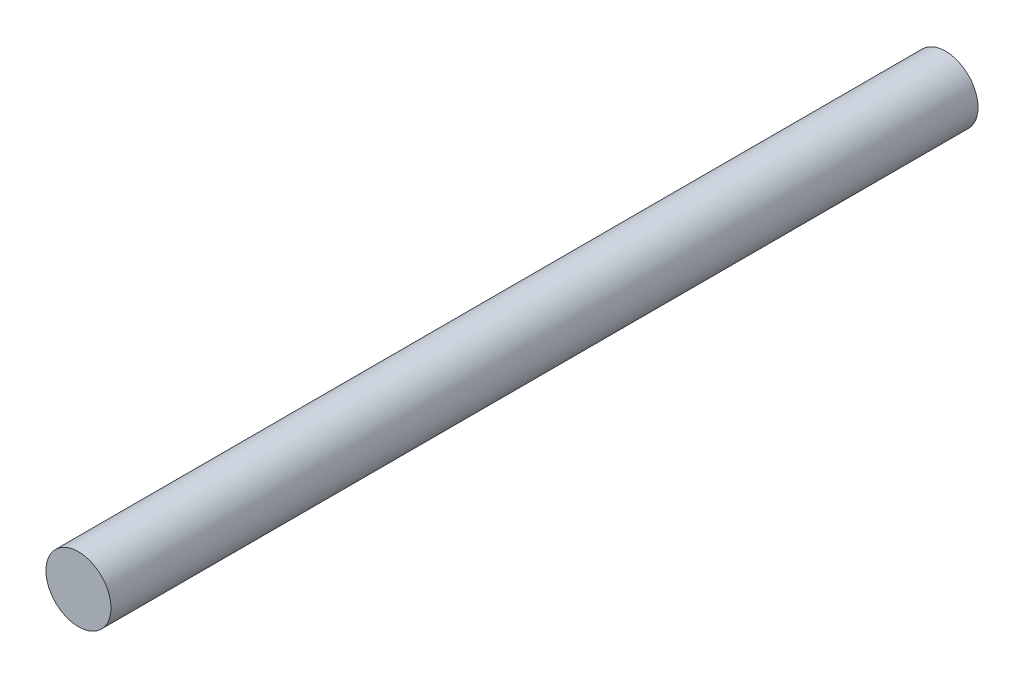
ISO-10303-21;
HEADER;
FILE_DESCRIPTION(('STEP AP214'),'2;1');
FILE_NAME('part.step','',(''),(''),'','','');
FILE_SCHEMA(('AUTOMOTIVE_DESIGN { 1 0 10303 214 1 1 1 1 }'));
ENDSEC;
DATA;
#1=APPLICATION_CONTEXT('core data for automotive mechanical design processes');
#2=APPLICATION_PROTOCOL_DEFINITION('international standard','automotive_design',2000,#1);
#3=PRODUCT_CONTEXT('',#1,'mechanical');
#4=PRODUCT('Part','Part','',(#3));
#5=PRODUCT_RELATED_PRODUCT_CATEGORY('part','',(#4));
#6=PRODUCT_DEFINITION_FORMATION('','',#4);
#7=PRODUCT_DEFINITION_CONTEXT('part definition',#1,'design');
#8=PRODUCT_DEFINITION('design','',#6,#7);
#9=PRODUCT_DEFINITION_SHAPE('','',#8);
#10=(LENGTH_UNIT() NAMED_UNIT(*) SI_UNIT(.MILLI.,.METRE.));
#11=(NAMED_UNIT(*) PLANE_ANGLE_UNIT() SI_UNIT($,.RADIAN.));
#12=(NAMED_UNIT(*) SI_UNIT($,.STERADIAN.) SOLID_ANGLE_UNIT());
#13=UNCERTAINTY_MEASURE_WITH_UNIT(LENGTH_MEASURE(1.E-05),#10,'distance_accuracy_value','');
#14=(GEOMETRIC_REPRESENTATION_CONTEXT(3) GLOBAL_UNCERTAINTY_ASSIGNED_CONTEXT((#13)) GLOBAL_UNIT_ASSIGNED_CONTEXT((#10,
#11,#12)) REPRESENTATION_CONTEXT('',''));
#15=CARTESIAN_POINT('',(0.,0.,0.));
#16=DIRECTION('',(0.,0.,1.));
#17=DIRECTION('',(1.,0.,0.));
#18=AXIS2_PLACEMENT_3D('',#15,#16,#17);
#19=CARTESIAN_POINT('',(0.,0.,20.));
#20=DIRECTION('',(0.,0.,-1.));
#21=DIRECTION('',(-1.,0.,0.));
#22=AXIS2_PLACEMENT_3D('',#19,#20,#21);
#23=CYLINDRICAL_SURFACE('',#22,0.75);
#24=CARTESIAN_POINT('',(0.,0.,20.));
#25=DIRECTION('',(0.,0.,1.));
#26=DIRECTION('',(1.,0.,0.));
#27=AXIS2_PLACEMENT_3D('',#24,#25,#26);
#28=CIRCLE('',#27,0.75);
#29=CARTESIAN_POINT('',(0.75,0.,20.));
#30=VERTEX_POINT('',#29);
#31=EDGE_CURVE('E10',#30,#30,#28,.T.);
#32=ORIENTED_EDGE('',*,*,#31,.F.);
#33=EDGE_LOOP('',(#32));
#34=FACE_BOUND('',#33,.T.);
#35=CARTESIAN_POINT('',(0.,0.,0.));
#36=DIRECTION('',(0.,0.,1.));
#37=DIRECTION('',(1.,0.,0.));
#38=AXIS2_PLACEMENT_3D('',#35,#36,#37);
#39=CIRCLE('',#38,0.75);
#40=CARTESIAN_POINT('',(0.75,0.,0.));
#41=VERTEX_POINT('',#40);
#42=EDGE_CURVE('E35',#41,#41,#39,.T.);
#43=ORIENTED_EDGE('',*,*,#42,.T.);
#44=EDGE_LOOP('',(#43));
#45=FACE_BOUND('',#44,.T.);
#46=ADVANCED_FACE('F32',(#34,#45),#23,.T.);
#47=CARTESIAN_POINT('',(0.,0.,20.));
#48=DIRECTION('',(0.,0.,1.));
#49=DIRECTION('',(1.,0.,0.));
#50=AXIS2_PLACEMENT_3D('',#47,#48,#49);
#51=PLANE('',#50);
#52=ORIENTED_EDGE('',*,*,#31,.T.);
#53=EDGE_LOOP('',(#52));
#54=FACE_BOUND('',#53,.T.);
#55=ADVANCED_FACE('F47',(#54),#51,.T.);
#56=CARTESIAN_POINT('',(0.,0.,0.));
#57=DIRECTION('',(0.,0.,1.));
#58=DIRECTION('',(1.,0.,0.));
#59=AXIS2_PLACEMENT_3D('',#56,#57,#58);
#60=PLANE('',#59);
#61=ORIENTED_EDGE('',*,*,#42,.F.);
#62=EDGE_LOOP('',(#61));
#63=FACE_BOUND('',#62,.T.);
#64=ADVANCED_FACE('F45',(#63),#60,.F.);
#65=CLOSED_SHELL('',(#46,#55,#64));
#66=MANIFOLD_SOLID_BREP('B2',#65);
#67=ADVANCED_BREP_SHAPE_REPRESENTATION('',(#18,#66),#14);
#68=SHAPE_DEFINITION_REPRESENTATION(#9,#67);
ENDSEC;
END-ISO-10303-21;
